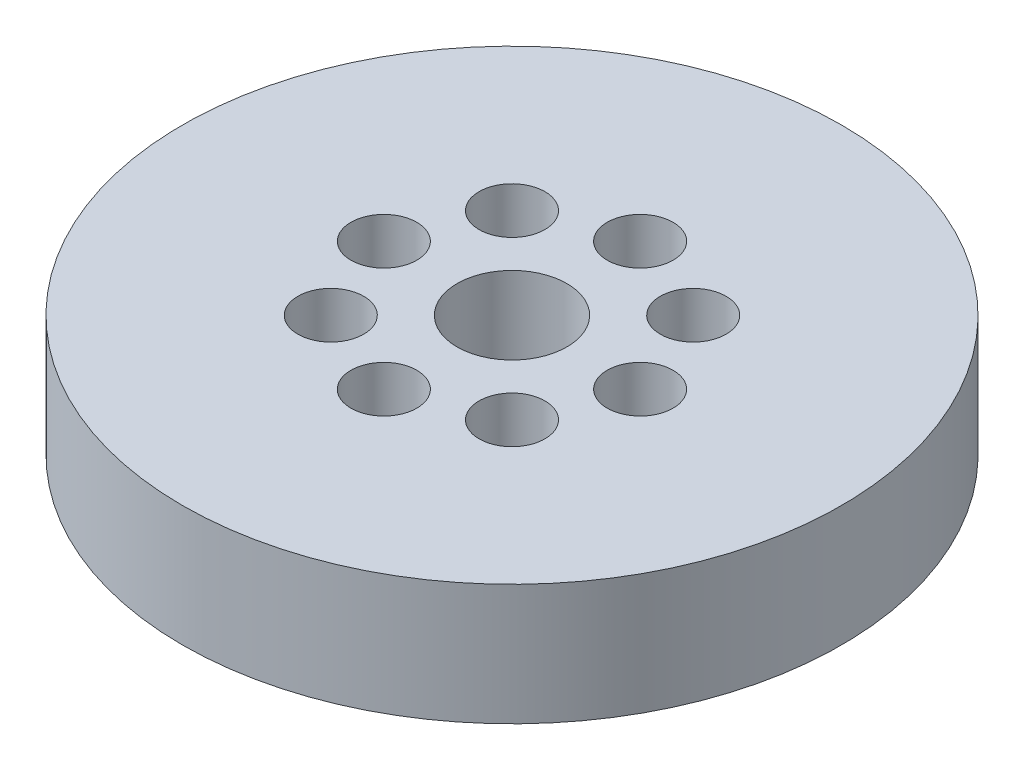
ISO-10303-21;
HEADER;
FILE_DESCRIPTION(('STEP AP214'),'2;1');
FILE_NAME('part.step','',(''),(''),'','','');
FILE_SCHEMA(('AUTOMOTIVE_DESIGN { 1 0 10303 214 1 1 1 1 }'));
ENDSEC;
DATA;
#1=APPLICATION_CONTEXT('core data for automotive mechanical design processes');
#2=APPLICATION_PROTOCOL_DEFINITION('international standard','automotive_design',2000,#1);
#3=PRODUCT_CONTEXT('',#1,'mechanical');
#4=PRODUCT('Part','Part','',(#3));
#5=PRODUCT_RELATED_PRODUCT_CATEGORY('part','',(#4));
#6=PRODUCT_DEFINITION_FORMATION('','',#4);
#7=PRODUCT_DEFINITION_CONTEXT('part definition',#1,'design');
#8=PRODUCT_DEFINITION('design','',#6,#7);
#9=PRODUCT_DEFINITION_SHAPE('','',#8);
#10=(LENGTH_UNIT() NAMED_UNIT(*) SI_UNIT(.MILLI.,.METRE.));
#11=(NAMED_UNIT(*) PLANE_ANGLE_UNIT() SI_UNIT($,.RADIAN.));
#12=(NAMED_UNIT(*) SI_UNIT($,.STERADIAN.) SOLID_ANGLE_UNIT());
#13=UNCERTAINTY_MEASURE_WITH_UNIT(LENGTH_MEASURE(1.E-05),#10,'distance_accuracy_value','');
#14=(GEOMETRIC_REPRESENTATION_CONTEXT(3) GLOBAL_UNCERTAINTY_ASSIGNED_CONTEXT((#13)) GLOBAL_UNIT_ASSIGNED_CONTEXT((#10,
#11,#12)) REPRESENTATION_CONTEXT('',''));
#15=CARTESIAN_POINT('',(0.,0.,0.));
#16=DIRECTION('',(0.,0.,1.));
#17=DIRECTION('',(1.,0.,0.));
#18=AXIS2_PLACEMENT_3D('',#15,#16,#17);
#19=CARTESIAN_POINT('',(0.,11.,0.));
#20=DIRECTION('',(0.,-1.,0.));
#21=DIRECTION('',(0.,0.,-1.));
#22=AXIS2_PLACEMENT_3D('',#19,#20,#21);
#23=CYLINDRICAL_SURFACE('',#22,30.);
#24=CARTESIAN_POINT('',(0.,11.,0.));
#25=DIRECTION('',(0.,1.,0.));
#26=DIRECTION('',(0.,0.,1.));
#27=AXIS2_PLACEMENT_3D('',#24,#25,#26);
#28=CIRCLE('',#27,30.);
#29=CARTESIAN_POINT('',(0.,11.,30.));
#30=VERTEX_POINT('',#29);
#31=EDGE_CURVE('E10',#30,#30,#28,.T.);
#32=ORIENTED_EDGE('',*,*,#31,.F.);
#33=EDGE_LOOP('',(#32));
#34=FACE_BOUND('',#33,.T.);
#35=CARTESIAN_POINT('',(0.,0.,0.));
#36=DIRECTION('',(0.,1.,0.));
#37=DIRECTION('',(0.,0.,1.));
#38=AXIS2_PLACEMENT_3D('',#35,#36,#37);
#39=CIRCLE('',#38,30.);
#40=CARTESIAN_POINT('',(0.,0.,30.));
#41=VERTEX_POINT('',#40);
#42=EDGE_CURVE('E37',#41,#41,#39,.T.);
#43=ORIENTED_EDGE('',*,*,#42,.T.);
#44=EDGE_LOOP('',(#43));
#45=FACE_BOUND('',#44,.T.);
#46=ADVANCED_FACE('F40',(#34,#45),#23,.T.);
#47=CARTESIAN_POINT('',(0.,11.,0.));
#48=DIRECTION('',(0.,1.,0.));
#49=DIRECTION('',(0.,0.,1.));
#50=AXIS2_PLACEMENT_3D('',#47,#48,#49);
#51=PLANE('',#50);
#52=CARTESIAN_POINT('',(0.,11.,11.6645786578634));
#53=DIRECTION('',(0.,1.,0.));
#54=DIRECTION('',(1.,0.,0.));
#55=AXIS2_PLACEMENT_3D('',#52,#53,#54);
#56=CIRCLE('',#55,2.99639712477738);
#57=CARTESIAN_POINT('',(2.99639712477742,11.,11.6645786578634));
#58=VERTEX_POINT('',#57);
#59=EDGE_CURVE('E88',#58,#58,#56,.T.);
#60=ORIENTED_EDGE('',*,*,#59,.F.);
#61=EDGE_LOOP('',(#60));
#62=FACE_BOUND('',#61,.T.);
#63=CARTESIAN_POINT('',(8.24810266865913,11.,8.24810266865904));
#64=DIRECTION('',(0.,1.,0.));
#65=DIRECTION('',(0.707106781186544,0.,-0.707106781186551));
#66=AXIS2_PLACEMENT_3D('',#63,#64,#65);
#67=CIRCLE('',#66,2.99639712477738);
#68=CARTESIAN_POINT('',(10.3668753947171,11.,6.12932994260107));
#69=VERTEX_POINT('',#68);
#70=EDGE_CURVE('E79',#69,#69,#67,.T.);
#71=ORIENTED_EDGE('',*,*,#70,.F.);
#72=EDGE_LOOP('',(#71));
#73=FACE_BOUND('',#72,.T.);
#74=CARTESIAN_POINT('',(11.6645786578634,11.,0.));
#75=DIRECTION('',(0.,1.,0.));
#76=DIRECTION('',(0.,0.,-1.));
#77=AXIS2_PLACEMENT_3D('',#74,#75,#76);
#78=CIRCLE('',#77,2.99639712477738);
#79=CARTESIAN_POINT('',(11.6645786578634,11.,-2.99639712477738));
#80=VERTEX_POINT('',#79);
#81=EDGE_CURVE('E74',#80,#80,#78,.T.);
#82=ORIENTED_EDGE('',*,*,#81,.F.);
#83=EDGE_LOOP('',(#82));
#84=FACE_BOUND('',#83,.T.);
#85=CARTESIAN_POINT('',(8.24810266865901,11.,-8.24810266865915));
#86=DIRECTION('',(0.,1.,0.));
#87=DIRECTION('',(-0.707106781186554,0.,-0.707106781186541));
#88=AXIS2_PLACEMENT_3D('',#85,#86,#87);
#89=CIRCLE('',#88,2.99639712477738);
#90=CARTESIAN_POINT('',(6.12932994260104,11.,-10.3668753947171));
#91=VERTEX_POINT('',#90);
#92=EDGE_CURVE('E70',#91,#91,#89,.T.);
#93=ORIENTED_EDGE('',*,*,#92,.F.);
#94=EDGE_LOOP('',(#93));
#95=FACE_BOUND('',#94,.T.);
#96=CARTESIAN_POINT('',(-1.22179976128194E-13,11.,-11.6645786578634));
#97=DIRECTION('',(0.,1.,0.));
#98=DIRECTION('',(-1.,0.,0.));
#99=AXIS2_PLACEMENT_3D('',#96,#97,#98);
#100=CIRCLE('',#99,2.99639712477738);
#101=CARTESIAN_POINT('',(-2.9963971247775,11.,-11.6645786578634));
#102=VERTEX_POINT('',#101);
#103=EDGE_CURVE('E100',#102,#102,#100,.T.);
#104=ORIENTED_EDGE('',*,*,#103,.F.);
#105=EDGE_LOOP('',(#104));
#106=FACE_BOUND('',#105,.T.);
#107=CARTESIAN_POINT('',(-8.24810266865918,11.,-8.24810266865898));
#108=DIRECTION('',(0.,1.,0.));
#109=DIRECTION('',(-0.707106781186539,0.,0.707106781186556));
#110=AXIS2_PLACEMENT_3D('',#107,#108,#109);
#111=CIRCLE('',#110,2.99639712477738);
#112=CARTESIAN_POINT('',(-10.3668753947171,11.,-6.129329942601));
#113=VERTEX_POINT('',#112);
#114=EDGE_CURVE('E93',#113,#113,#111,.T.);
#115=ORIENTED_EDGE('',*,*,#114,.F.);
#116=EDGE_LOOP('',(#115));
#117=FACE_BOUND('',#116,.T.);
#118=CARTESIAN_POINT('',(-8.24810266865907,11.,8.2481026686591));
#119=DIRECTION('',(0.,1.,0.));
#120=DIRECTION('',(0.707106781186549,0.,0.707106781186546));
#121=AXIS2_PLACEMENT_3D('',#118,#119,#120);
#122=CIRCLE('',#121,2.99639712477738);
#123=CARTESIAN_POINT('',(-6.12932994260111,11.,10.3668753947171));
#124=VERTEX_POINT('',#123);
#125=EDGE_CURVE('E61',#124,#124,#122,.T.);
#126=ORIENTED_EDGE('',*,*,#125,.F.);
#127=EDGE_LOOP('',(#126));
#128=FACE_BOUND('',#127,.T.);
#129=CARTESIAN_POINT('',(-11.6645786578634,11.,0.));
#130=DIRECTION('',(0.,1.,0.));
#131=DIRECTION('',(0.,0.,1.));
#132=AXIS2_PLACEMENT_3D('',#129,#130,#131);
#133=CIRCLE('',#132,2.99639712477738);
#134=CARTESIAN_POINT('',(-11.6645786578634,11.,2.99639712477738));
#135=VERTEX_POINT('',#134);
#136=EDGE_CURVE('E54',#135,#135,#133,.T.);
#137=ORIENTED_EDGE('',*,*,#136,.F.);
#138=EDGE_LOOP('',(#137));
#139=FACE_BOUND('',#138,.T.);
#140=CARTESIAN_POINT('',(0.,11.,0.));
#141=DIRECTION('',(0.,1.,0.));
#142=DIRECTION('',(0.,0.,1.));
#143=AXIS2_PLACEMENT_3D('',#140,#141,#142);
#144=CIRCLE('',#143,5.);
#145=CARTESIAN_POINT('',(0.,11.,5.));
#146=VERTEX_POINT('',#145);
#147=EDGE_CURVE('E50',#146,#146,#144,.T.);
#148=ORIENTED_EDGE('',*,*,#147,.F.);
#149=EDGE_LOOP('',(#148));
#150=FACE_BOUND('',#149,.T.);
#151=ORIENTED_EDGE('',*,*,#31,.T.);
#152=EDGE_LOOP('',(#151));
#153=FACE_BOUND('',#152,.T.);
#154=ADVANCED_FACE('F115',(#62,#73,#84,#95,#106,#117,#128,#139,#150,#153),#51,.T.);
#155=CARTESIAN_POINT('',(0.,0.,0.));
#156=DIRECTION('',(0.,1.,0.));
#157=DIRECTION('',(0.,0.,1.));
#158=AXIS2_PLACEMENT_3D('',#155,#156,#157);
#159=PLANE('',#158);
#160=CARTESIAN_POINT('',(0.,0.,0.));
#161=DIRECTION('',(0.,1.,0.));
#162=DIRECTION('',(0.,0.,1.));
#163=AXIS2_PLACEMENT_3D('',#160,#161,#162);
#164=CIRCLE('',#163,5.);
#165=CARTESIAN_POINT('',(0.,0.,5.));
#166=VERTEX_POINT('',#165);
#167=EDGE_CURVE('E47',#166,#166,#164,.T.);
#168=ORIENTED_EDGE('',*,*,#167,.T.);
#169=EDGE_LOOP('',(#168));
#170=FACE_BOUND('',#169,.T.);
#171=ORIENTED_EDGE('',*,*,#42,.F.);
#172=EDGE_LOOP('',(#171));
#173=FACE_BOUND('',#172,.T.);
#174=ADVANCED_FACE('F113',(#170,#173),#159,.F.);
#175=CARTESIAN_POINT('',(0.,11.,0.));
#176=DIRECTION('',(0.,-1.,0.));
#177=DIRECTION('',(0.,0.,-1.));
#178=AXIS2_PLACEMENT_3D('',#175,#176,#177);
#179=CYLINDRICAL_SURFACE('',#178,5.);
#180=ORIENTED_EDGE('',*,*,#147,.T.);
#181=EDGE_LOOP('',(#180));
#182=FACE_BOUND('',#181,.T.);
#183=ORIENTED_EDGE('',*,*,#167,.F.);
#184=EDGE_LOOP('',(#183));
#185=FACE_BOUND('',#184,.T.);
#186=ADVANCED_FACE('F127',(#182,#185),#179,.F.);
#187=CARTESIAN_POINT('',(-11.6645786578634,2.74594669466737,0.));
#188=DIRECTION('',(0.,1.,0.));
#189=DIRECTION('',(0.,0.,1.));
#190=AXIS2_PLACEMENT_3D('',#187,#188,#189);
#191=CYLINDRICAL_SURFACE('',#190,2.99639712477738);
#192=CARTESIAN_POINT('',(-11.6645786578634,2.74594669466737,0.));
#193=DIRECTION('',(0.,1.,0.));
#194=DIRECTION('',(0.,0.,1.));
#195=AXIS2_PLACEMENT_3D('',#192,#193,#194);
#196=CIRCLE('',#195,2.99639712477738);
#197=CARTESIAN_POINT('',(-11.6645786578634,2.74594669466737,2.99639712477738));
#198=VERTEX_POINT('',#197);
#199=EDGE_CURVE('E55',#198,#198,#196,.T.);
#200=ORIENTED_EDGE('',*,*,#199,.F.);
#201=EDGE_LOOP('',(#200));
#202=FACE_BOUND('',#201,.T.);
#203=ORIENTED_EDGE('',*,*,#136,.T.);
#204=EDGE_LOOP('',(#203));
#205=FACE_BOUND('',#204,.T.);
#206=ADVANCED_FACE('F129',(#202,#205),#191,.F.);
#207=CARTESIAN_POINT('',(-11.6645786578634,2.74594669466737,0.));
#208=DIRECTION('',(0.,1.,0.));
#209=DIRECTION('',(0.,0.,1.));
#210=AXIS2_PLACEMENT_3D('',#207,#208,#209);
#211=PLANE('',#210);
#212=ORIENTED_EDGE('',*,*,#199,.T.);
#213=EDGE_LOOP('',(#212));
#214=FACE_BOUND('',#213,.T.);
#215=ADVANCED_FACE('F157',(#214),#211,.T.);
#216=CARTESIAN_POINT('',(-8.24810266865907,2.74594669466737,8.2481026686591));
#217=DIRECTION('',(0.,1.,0.));
#218=DIRECTION('',(0.,0.,1.));
#219=AXIS2_PLACEMENT_3D('',#216,#217,#218);
#220=CYLINDRICAL_SURFACE('',#219,2.99639712477738);
#221=CARTESIAN_POINT('',(-8.24810266865907,2.74594669466737,8.2481026686591));
#222=DIRECTION('',(0.,1.,0.));
#223=DIRECTION('',(0.707106781186549,0.,0.707106781186546));
#224=AXIS2_PLACEMENT_3D('',#221,#222,#223);
#225=CIRCLE('',#224,2.99639712477738);
#226=CARTESIAN_POINT('',(-6.12932994260111,2.74594669466737,10.3668753947171));
#227=VERTEX_POINT('',#226);
#228=EDGE_CURVE('E59',#227,#227,#225,.T.);
#229=ORIENTED_EDGE('',*,*,#228,.F.);
#230=EDGE_LOOP('',(#229));
#231=FACE_BOUND('',#230,.T.);
#232=ORIENTED_EDGE('',*,*,#125,.T.);
#233=EDGE_LOOP('',(#232));
#234=FACE_BOUND('',#233,.T.);
#235=ADVANCED_FACE('F170',(#231,#234),#220,.F.);
#236=CARTESIAN_POINT('',(-8.24810266865907,2.74594669466737,8.2481026686591));
#237=DIRECTION('',(0.,1.,0.));
#238=DIRECTION('',(0.707106781186549,0.,0.707106781186546));
#239=AXIS2_PLACEMENT_3D('',#236,#237,#238);
#240=PLANE('',#239);
#241=ORIENTED_EDGE('',*,*,#228,.T.);
#242=EDGE_LOOP('',(#241));
#243=FACE_BOUND('',#242,.T.);
#244=ADVANCED_FACE('F182',(#243),#240,.T.);
#245=CARTESIAN_POINT('',(-8.24810266865918,2.74594669466737,-8.24810266865898));
#246=DIRECTION('',(0.,1.,0.));
#247=DIRECTION('',(0.,0.,1.));
#248=AXIS2_PLACEMENT_3D('',#245,#246,#247);
#249=CYLINDRICAL_SURFACE('',#248,2.99639712477738);
#250=CARTESIAN_POINT('',(-8.24810266865918,2.74594669466737,-8.24810266865898));
#251=DIRECTION('',(0.,1.,0.));
#252=DIRECTION('',(-0.707106781186539,0.,0.707106781186556));
#253=AXIS2_PLACEMENT_3D('',#250,#251,#252);
#254=CIRCLE('',#253,2.99639712477738);
#255=CARTESIAN_POINT('',(-10.3668753947171,2.74594669466737,-6.129329942601));
#256=VERTEX_POINT('',#255);
#257=EDGE_CURVE('E94',#256,#256,#254,.T.);
#258=ORIENTED_EDGE('',*,*,#257,.F.);
#259=EDGE_LOOP('',(#258));
#260=FACE_BOUND('',#259,.T.);
#261=ORIENTED_EDGE('',*,*,#114,.T.);
#262=EDGE_LOOP('',(#261));
#263=FACE_BOUND('',#262,.T.);
#264=ADVANCED_FACE('F189',(#260,#263),#249,.F.);
#265=CARTESIAN_POINT('',(-8.24810266865918,2.74594669466737,-8.24810266865898));
#266=DIRECTION('',(0.,1.,0.));
#267=DIRECTION('',(-0.707106781186539,0.,0.707106781186556));
#268=AXIS2_PLACEMENT_3D('',#265,#266,#267);
#269=PLANE('',#268);
#270=ORIENTED_EDGE('',*,*,#257,.T.);
#271=EDGE_LOOP('',(#270));
#272=FACE_BOUND('',#271,.T.);
#273=ADVANCED_FACE('F107',(#272),#269,.T.);
#274=CARTESIAN_POINT('',(-1.22179976128194E-13,2.74594669466737,-11.6645786578634));
#275=DIRECTION('',(0.,1.,0.));
#276=DIRECTION('',(0.,0.,1.));
#277=AXIS2_PLACEMENT_3D('',#274,#275,#276);
#278=CYLINDRICAL_SURFACE('',#277,2.99639712477738);
#279=CARTESIAN_POINT('',(-1.22179976128194E-13,2.74594669466737,-11.6645786578634));
#280=DIRECTION('',(0.,1.,0.));
#281=DIRECTION('',(-1.,0.,0.));
#282=AXIS2_PLACEMENT_3D('',#279,#280,#281);
#283=CIRCLE('',#282,2.99639712477738);
#284=CARTESIAN_POINT('',(-2.9963971247775,2.74594669466737,-11.6645786578634));
#285=VERTEX_POINT('',#284);
#286=EDGE_CURVE('E72',#285,#285,#283,.T.);
#287=ORIENTED_EDGE('',*,*,#286,.F.);
#288=EDGE_LOOP('',(#287));
#289=FACE_BOUND('',#288,.T.);
#290=ORIENTED_EDGE('',*,*,#103,.T.);
#291=EDGE_LOOP('',(#290));
#292=FACE_BOUND('',#291,.T.);
#293=ADVANCED_FACE('F104',(#289,#292),#278,.F.);
#294=CARTESIAN_POINT('',(-1.22179976128194E-13,2.74594669466737,-11.6645786578634));
#295=DIRECTION('',(0.,1.,0.));
#296=DIRECTION('',(-1.,0.,0.));
#297=AXIS2_PLACEMENT_3D('',#294,#295,#296);
#298=PLANE('',#297);
#299=ORIENTED_EDGE('',*,*,#286,.T.);
#300=EDGE_LOOP('',(#299));
#301=FACE_BOUND('',#300,.T.);
#302=ADVANCED_FACE('F103',(#301),#298,.T.);
#303=CARTESIAN_POINT('',(8.24810266865901,2.74594669466737,-8.24810266865915));
#304=DIRECTION('',(0.,1.,0.));
#305=DIRECTION('',(0.,0.,1.));
#306=AXIS2_PLACEMENT_3D('',#303,#304,#305);
#307=CYLINDRICAL_SURFACE('',#306,2.99639712477738);
#308=CARTESIAN_POINT('',(8.24810266865901,2.74594669466737,-8.24810266865915));
#309=DIRECTION('',(0.,1.,0.));
#310=DIRECTION('',(-0.707106781186554,0.,-0.707106781186541));
#311=AXIS2_PLACEMENT_3D('',#308,#309,#310);
#312=CIRCLE('',#311,2.99639712477738);
#313=CARTESIAN_POINT('',(6.12932994260104,2.74594669466737,-10.3668753947171));
#314=VERTEX_POINT('',#313);
#315=EDGE_CURVE('E69',#314,#314,#312,.T.);
#316=ORIENTED_EDGE('',*,*,#315,.F.);
#317=EDGE_LOOP('',(#316));
#318=FACE_BOUND('',#317,.T.);
#319=ORIENTED_EDGE('',*,*,#92,.T.);
#320=EDGE_LOOP('',(#319));
#321=FACE_BOUND('',#320,.T.);
#322=ADVANCED_FACE('F219',(#318,#321),#307,.F.);
#323=CARTESIAN_POINT('',(8.24810266865901,2.74594669466737,-8.24810266865915));
#324=DIRECTION('',(0.,1.,0.));
#325=DIRECTION('',(-0.707106781186554,0.,-0.707106781186541));
#326=AXIS2_PLACEMENT_3D('',#323,#324,#325);
#327=PLANE('',#326);
#328=ORIENTED_EDGE('',*,*,#315,.T.);
#329=EDGE_LOOP('',(#328));
#330=FACE_BOUND('',#329,.T.);
#331=ADVANCED_FACE('F227',(#330),#327,.T.);
#332=CARTESIAN_POINT('',(11.6645786578634,2.74594669466737,0.));
#333=DIRECTION('',(0.,1.,0.));
#334=DIRECTION('',(0.,0.,1.));
#335=AXIS2_PLACEMENT_3D('',#332,#333,#334);
#336=CYLINDRICAL_SURFACE('',#335,2.99639712477738);
#337=CARTESIAN_POINT('',(11.6645786578634,2.74594669466737,0.));
#338=DIRECTION('',(0.,1.,0.));
#339=DIRECTION('',(0.,0.,-1.));
#340=AXIS2_PLACEMENT_3D('',#337,#338,#339);
#341=CIRCLE('',#340,2.99639712477738);
#342=CARTESIAN_POINT('',(11.6645786578634,2.74594669466737,-2.99639712477738));
#343=VERTEX_POINT('',#342);
#344=EDGE_CURVE('E80',#343,#343,#341,.T.);
#345=ORIENTED_EDGE('',*,*,#344,.F.);
#346=EDGE_LOOP('',(#345));
#347=FACE_BOUND('',#346,.T.);
#348=ORIENTED_EDGE('',*,*,#81,.T.);
#349=EDGE_LOOP('',(#348));
#350=FACE_BOUND('',#349,.T.);
#351=ADVANCED_FACE('F240',(#347,#350),#336,.F.);
#352=CARTESIAN_POINT('',(11.6645786578634,2.74594669466737,0.));
#353=DIRECTION('',(0.,1.,0.));
#354=DIRECTION('',(0.,0.,-1.));
#355=AXIS2_PLACEMENT_3D('',#352,#353,#354);
#356=PLANE('',#355);
#357=ORIENTED_EDGE('',*,*,#344,.T.);
#358=EDGE_LOOP('',(#357));
#359=FACE_BOUND('',#358,.T.);
#360=ADVANCED_FACE('F246',(#359),#356,.T.);
#361=CARTESIAN_POINT('',(8.24810266865913,2.74594669466737,8.24810266865904));
#362=DIRECTION('',(0.,1.,0.));
#363=DIRECTION('',(0.,0.,1.));
#364=AXIS2_PLACEMENT_3D('',#361,#362,#363);
#365=CYLINDRICAL_SURFACE('',#364,2.99639712477738);
#366=CARTESIAN_POINT('',(8.24810266865913,2.74594669466737,8.24810266865904));
#367=DIRECTION('',(0.,1.,0.));
#368=DIRECTION('',(0.707106781186544,0.,-0.707106781186551));
#369=AXIS2_PLACEMENT_3D('',#366,#367,#368);
#370=CIRCLE('',#369,2.99639712477738);
#371=CARTESIAN_POINT('',(10.3668753947171,2.74594669466737,6.12932994260107));
#372=VERTEX_POINT('',#371);
#373=EDGE_CURVE('E82',#372,#372,#370,.T.);
#374=ORIENTED_EDGE('',*,*,#373,.F.);
#375=EDGE_LOOP('',(#374));
#376=FACE_BOUND('',#375,.T.);
#377=ORIENTED_EDGE('',*,*,#70,.T.);
#378=EDGE_LOOP('',(#377));
#379=FACE_BOUND('',#378,.T.);
#380=ADVANCED_FACE('F254',(#376,#379),#365,.F.);
#381=CARTESIAN_POINT('',(8.24810266865913,2.74594669466737,8.24810266865904));
#382=DIRECTION('',(0.,1.,0.));
#383=DIRECTION('',(0.707106781186544,0.,-0.707106781186551));
#384=AXIS2_PLACEMENT_3D('',#381,#382,#383);
#385=PLANE('',#384);
#386=ORIENTED_EDGE('',*,*,#373,.T.);
#387=EDGE_LOOP('',(#386));
#388=FACE_BOUND('',#387,.T.);
#389=ADVANCED_FACE('F262',(#388),#385,.T.);
#390=CARTESIAN_POINT('',(0.,2.74594669466737,11.6645786578634));
#391=DIRECTION('',(0.,1.,0.));
#392=DIRECTION('',(0.,0.,1.));
#393=AXIS2_PLACEMENT_3D('',#390,#391,#392);
#394=CYLINDRICAL_SURFACE('',#393,2.99639712477738);
#395=CARTESIAN_POINT('',(0.,2.74594669466737,11.6645786578634));
#396=DIRECTION('',(0.,1.,0.));
#397=DIRECTION('',(1.,0.,0.));
#398=AXIS2_PLACEMENT_3D('',#395,#396,#397);
#399=CIRCLE('',#398,2.99639712477738);
#400=CARTESIAN_POINT('',(2.99639712477742,2.74594669466737,11.6645786578634));
#401=VERTEX_POINT('',#400);
#402=EDGE_CURVE('E63',#401,#401,#399,.T.);
#403=ORIENTED_EDGE('',*,*,#402,.F.);
#404=EDGE_LOOP('',(#403));
#405=FACE_BOUND('',#404,.T.);
#406=ORIENTED_EDGE('',*,*,#59,.T.);
#407=EDGE_LOOP('',(#406));
#408=FACE_BOUND('',#407,.T.);
#409=ADVANCED_FACE('F272',(#405,#408),#394,.F.);
#410=CARTESIAN_POINT('',(0.,2.74594669466737,11.6645786578634));
#411=DIRECTION('',(0.,1.,0.));
#412=DIRECTION('',(1.,0.,0.));
#413=AXIS2_PLACEMENT_3D('',#410,#411,#412);
#414=PLANE('',#413);
#415=ORIENTED_EDGE('',*,*,#402,.T.);
#416=EDGE_LOOP('',(#415));
#417=FACE_BOUND('',#416,.T.);
#418=ADVANCED_FACE('F285',(#417),#414,.T.);
#419=CLOSED_SHELL('',(#46,#154,#174,#186,#206,#215,#235,#244,#264,#273,#293,#302,#322,#331,#351,
#360,#380,#389,#409,#418));
#420=MANIFOLD_SOLID_BREP('B2',#419);
#421=ADVANCED_BREP_SHAPE_REPRESENTATION('',(#18,#420),#14);
#422=SHAPE_DEFINITION_REPRESENTATION(#9,#421);
ENDSEC;
END-ISO-10303-21;
